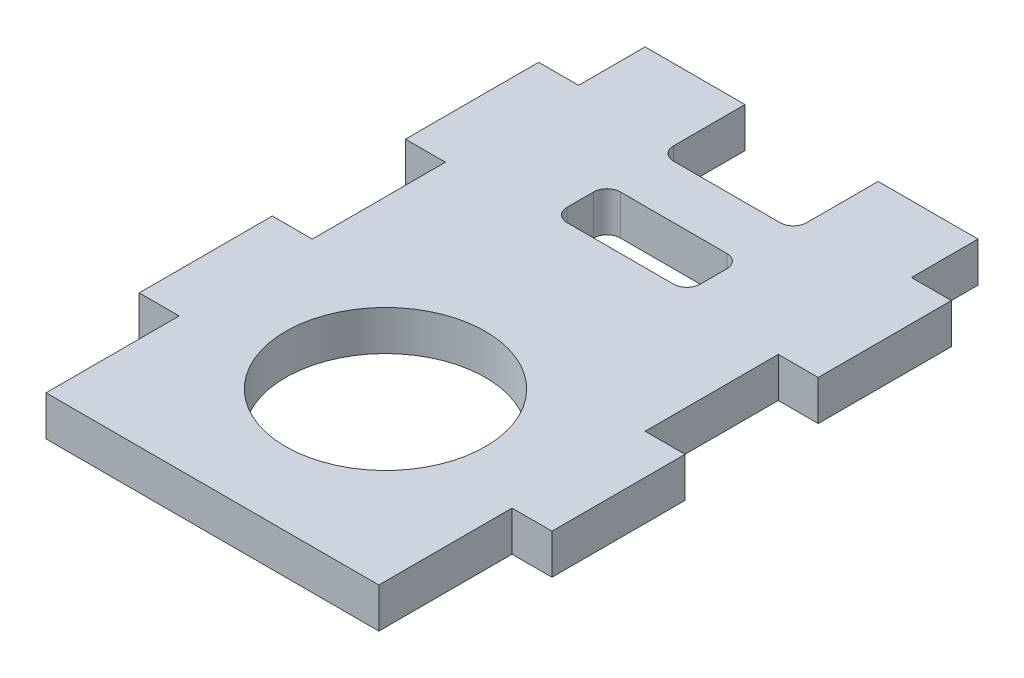
ISO-10303-21;
HEADER;
FILE_DESCRIPTION(('STEP AP214'),'2;1');
FILE_NAME('part.step','',(''),(''),'','','');
FILE_SCHEMA(('AUTOMOTIVE_DESIGN { 1 0 10303 214 1 1 1 1 }'));
ENDSEC;
DATA;
#1=APPLICATION_CONTEXT('core data for automotive mechanical design processes');
#2=APPLICATION_PROTOCOL_DEFINITION('international standard','automotive_design',2000,#1);
#3=PRODUCT_CONTEXT('',#1,'mechanical');
#4=PRODUCT('Part','Part','',(#3));
#5=PRODUCT_RELATED_PRODUCT_CATEGORY('part','',(#4));
#6=PRODUCT_DEFINITION_FORMATION('','',#4);
#7=PRODUCT_DEFINITION_CONTEXT('part definition',#1,'design');
#8=PRODUCT_DEFINITION('design','',#6,#7);
#9=PRODUCT_DEFINITION_SHAPE('','',#8);
#10=(LENGTH_UNIT() NAMED_UNIT(*) SI_UNIT(.MILLI.,.METRE.));
#11=(NAMED_UNIT(*) PLANE_ANGLE_UNIT() SI_UNIT($,.RADIAN.));
#12=(NAMED_UNIT(*) SI_UNIT($,.STERADIAN.) SOLID_ANGLE_UNIT());
#13=UNCERTAINTY_MEASURE_WITH_UNIT(LENGTH_MEASURE(1.E-05),#10,'distance_accuracy_value','');
#14=(GEOMETRIC_REPRESENTATION_CONTEXT(3) GLOBAL_UNCERTAINTY_ASSIGNED_CONTEXT((#13)) GLOBAL_UNIT_ASSIGNED_CONTEXT((#10,
#11,#12)) REPRESENTATION_CONTEXT('',''));
#15=CARTESIAN_POINT('',(0.,0.,0.));
#16=DIRECTION('',(0.,0.,1.));
#17=DIRECTION('',(1.,0.,0.));
#18=AXIS2_PLACEMENT_3D('',#15,#16,#17);
#19=CARTESIAN_POINT('',(-12.5,3.,22.5));
#20=DIRECTION('',(1.,0.,0.));
#21=DIRECTION('',(0.,0.,-1.));
#22=AXIS2_PLACEMENT_3D('',#19,#20,#21);
#23=PLANE('',#22);
#24=DIRECTION('',(0.,0.,1.));
#25=VECTOR('',#24,1.);
#26=CARTESIAN_POINT('',(-12.5,3.,22.5));
#27=LINE('',#26,#25);
#28=CARTESIAN_POINT('',(-12.5,3.,-7.49999999999999));
#29=VERTEX_POINT('',#28);
#30=CARTESIAN_POINT('',(-12.5,3.,2.50000000000002));
#31=VERTEX_POINT('',#30);
#32=EDGE_CURVE('E37',#29,#31,#27,.T.);
#33=ORIENTED_EDGE('',*,*,#32,.F.);
#34=DIRECTION('',(0.,1.,0.));
#35=VECTOR('',#34,1.);
#36=CARTESIAN_POINT('',(-12.5,-10.4403065089106,-7.5));
#37=LINE('',#36,#35);
#38=CARTESIAN_POINT('',(-12.5,0.,-7.5));
#39=VERTEX_POINT('',#38);
#40=EDGE_CURVE('E268',#39,#29,#37,.T.);
#41=ORIENTED_EDGE('',*,*,#40,.F.);
#42=DIRECTION('',(0.,0.,1.));
#43=VECTOR('',#42,1.);
#44=CARTESIAN_POINT('',(-12.5,0.,22.5));
#45=LINE('',#44,#43);
#46=CARTESIAN_POINT('',(-12.5,0.,2.5));
#47=VERTEX_POINT('',#46);
#48=EDGE_CURVE('E266',#39,#47,#45,.T.);
#49=ORIENTED_EDGE('',*,*,#48,.T.);
#50=DIRECTION('',(0.,1.,0.));
#51=VECTOR('',#50,1.);
#52=CARTESIAN_POINT('',(-12.5,-10.4403065089106,2.5));
#53=LINE('',#52,#51);
#54=EDGE_CURVE('E311',#47,#31,#53,.T.);
#55=ORIENTED_EDGE('',*,*,#54,.T.);
#56=EDGE_LOOP('',(#33,#41,#49,#55));
#57=FACE_BOUND('',#56,.T.);
#58=ADVANCED_FACE('F33',(#57),#23,.F.);
#59=DIRECTION('',(0.,1.,0.));
#60=VECTOR('',#59,1.);
#61=CARTESIAN_POINT('',(-12.5,-10.4403065089106,12.5));
#62=LINE('',#61,#60);
#63=CARTESIAN_POINT('',(-12.5,0.,12.5));
#64=VERTEX_POINT('',#63);
#65=CARTESIAN_POINT('',(-12.5,3.,12.5));
#66=VERTEX_POINT('',#65);
#67=EDGE_CURVE('E308',#64,#66,#62,.T.);
#68=ORIENTED_EDGE('',*,*,#67,.F.);
#69=CARTESIAN_POINT('',(-12.5,0.,22.5));
#70=VERTEX_POINT('',#69);
#71=EDGE_CURVE('E324',#64,#70,#45,.T.);
#72=ORIENTED_EDGE('',*,*,#71,.T.);
#73=DIRECTION('',(0.,-1.,0.));
#74=VECTOR('',#73,1.);
#75=CARTESIAN_POINT('',(-12.5,3.,22.5));
#76=LINE('',#75,#74);
#77=CARTESIAN_POINT('',(-12.5,3.,22.5));
#78=VERTEX_POINT('',#77);
#79=EDGE_CURVE('E402',#78,#70,#76,.T.);
#80=ORIENTED_EDGE('',*,*,#79,.F.);
#81=EDGE_CURVE('E374',#66,#78,#27,.T.);
#82=ORIENTED_EDGE('',*,*,#81,.F.);
#83=EDGE_LOOP('',(#68,#72,#80,#82));
#84=FACE_BOUND('',#83,.T.);
#85=ADVANCED_FACE('F409',(#84),#23,.F.);
#86=CARTESIAN_POINT('',(12.5,3.,22.5));
#87=DIRECTION('',(-1.,0.,0.));
#88=DIRECTION('',(0.,0.,1.));
#89=AXIS2_PLACEMENT_3D('',#86,#87,#88);
#90=PLANE('',#89);
#91=DIRECTION('',(0.,0.,-1.));
#92=VECTOR('',#91,1.);
#93=CARTESIAN_POINT('',(12.5,0.,22.5));
#94=LINE('',#93,#92);
#95=CARTESIAN_POINT('',(12.5,0.,22.5));
#96=VERTEX_POINT('',#95);
#97=CARTESIAN_POINT('',(12.5,0.,12.5));
#98=VERTEX_POINT('',#97);
#99=EDGE_CURVE('E362',#96,#98,#94,.T.);
#100=ORIENTED_EDGE('',*,*,#99,.T.);
#101=DIRECTION('',(0.,1.,0.));
#102=VECTOR('',#101,1.);
#103=CARTESIAN_POINT('',(12.5,-10.4403065089106,12.5));
#104=LINE('',#103,#102);
#105=CARTESIAN_POINT('',(12.5,3.,12.5));
#106=VERTEX_POINT('',#105);
#107=EDGE_CURVE('E968',#98,#106,#104,.T.);
#108=ORIENTED_EDGE('',*,*,#107,.T.);
#109=DIRECTION('',(0.,0.,-1.));
#110=VECTOR('',#109,1.);
#111=CARTESIAN_POINT('',(12.5,3.,22.5));
#112=LINE('',#111,#110);
#113=CARTESIAN_POINT('',(12.5,3.,22.5));
#114=VERTEX_POINT('',#113);
#115=EDGE_CURVE('E341',#114,#106,#112,.T.);
#116=ORIENTED_EDGE('',*,*,#115,.F.);
#117=DIRECTION('',(0.,-1.,0.));
#118=VECTOR('',#117,1.);
#119=CARTESIAN_POINT('',(12.5,3.,22.5));
#120=LINE('',#119,#118);
#121=EDGE_CURVE('E368',#114,#96,#120,.T.);
#122=ORIENTED_EDGE('',*,*,#121,.T.);
#123=EDGE_LOOP('',(#100,#108,#116,#122));
#124=FACE_BOUND('',#123,.T.);
#125=ADVANCED_FACE('F421',(#124),#90,.F.);
#126=DIRECTION('',(0.,1.,0.));
#127=VECTOR('',#126,1.);
#128=CARTESIAN_POINT('',(12.5,-10.4403065089106,-17.5));
#129=LINE('',#128,#127);
#130=CARTESIAN_POINT('',(12.5,0.,-17.5));
#131=VERTEX_POINT('',#130);
#132=CARTESIAN_POINT('',(12.5,3.,-17.5));
#133=VERTEX_POINT('',#132);
#134=EDGE_CURVE('E466',#131,#133,#129,.T.);
#135=ORIENTED_EDGE('',*,*,#134,.F.);
#136=CARTESIAN_POINT('',(12.5,0.,-22.5));
#137=VERTEX_POINT('',#136);
#138=EDGE_CURVE('E359',#131,#137,#94,.T.);
#139=ORIENTED_EDGE('',*,*,#138,.T.);
#140=DIRECTION('',(0.,-1.,0.));
#141=VECTOR('',#140,1.);
#142=CARTESIAN_POINT('',(12.5,3.,-22.5));
#143=LINE('',#142,#141);
#144=CARTESIAN_POINT('',(12.5,3.,-22.5));
#145=VERTEX_POINT('',#144);
#146=EDGE_CURVE('E401',#145,#137,#143,.T.);
#147=ORIENTED_EDGE('',*,*,#146,.F.);
#148=EDGE_CURVE('E342',#133,#145,#112,.T.);
#149=ORIENTED_EDGE('',*,*,#148,.F.);
#150=EDGE_LOOP('',(#135,#139,#147,#149));
#151=FACE_BOUND('',#150,.T.);
#152=ADVANCED_FACE('F426',(#151),#90,.F.);
#153=CARTESIAN_POINT('',(-12.5,3.,-22.5));
#154=DIRECTION('',(0.,0.,1.));
#155=DIRECTION('',(1.,0.,0.));
#156=AXIS2_PLACEMENT_3D('',#153,#154,#155);
#157=PLANE('',#156);
#158=DIRECTION('',(-1.,0.,0.));
#159=VECTOR('',#158,1.);
#160=CARTESIAN_POINT('',(-12.5,3.,-22.5));
#161=LINE('',#160,#159);
#162=CARTESIAN_POINT('',(-5.,3.,-22.5));
#163=VERTEX_POINT('',#162);
#164=CARTESIAN_POINT('',(-12.5,3.,-22.5));
#165=VERTEX_POINT('',#164);
#166=EDGE_CURVE('E358',#163,#165,#161,.T.);
#167=ORIENTED_EDGE('',*,*,#166,.F.);
#168=DIRECTION('',(0.,1.,0.));
#169=VECTOR('',#168,1.);
#170=CARTESIAN_POINT('',(-5.,0.,-22.5));
#171=LINE('',#170,#169);
#172=CARTESIAN_POINT('',(-5.,0.,-22.5));
#173=VERTEX_POINT('',#172);
#174=EDGE_CURVE('E515',#173,#163,#171,.T.);
#175=ORIENTED_EDGE('',*,*,#174,.F.);
#176=DIRECTION('',(-1.,0.,0.));
#177=VECTOR('',#176,1.);
#178=CARTESIAN_POINT('',(-12.5,0.,-22.5));
#179=LINE('',#178,#177);
#180=CARTESIAN_POINT('',(-12.5,0.,-22.5));
#181=VERTEX_POINT('',#180);
#182=EDGE_CURVE('E399',#173,#181,#179,.T.);
#183=ORIENTED_EDGE('',*,*,#182,.T.);
#184=DIRECTION('',(0.,-1.,0.));
#185=VECTOR('',#184,1.);
#186=CARTESIAN_POINT('',(-12.5,3.,-22.5));
#187=LINE('',#186,#185);
#188=EDGE_CURVE('E396',#165,#181,#187,.T.);
#189=ORIENTED_EDGE('',*,*,#188,.F.);
#190=EDGE_LOOP('',(#167,#175,#183,#189));
#191=FACE_BOUND('',#190,.T.);
#192=ADVANCED_FACE('F397',(#191),#157,.F.);
#193=CARTESIAN_POINT('',(12.5,3.,2.50000000000001));
#194=VERTEX_POINT('',#193);
#195=CARTESIAN_POINT('',(12.5,3.,-7.49999999999998));
#196=VERTEX_POINT('',#195);
#197=EDGE_CURVE('E338',#194,#196,#112,.T.);
#198=ORIENTED_EDGE('',*,*,#197,.F.);
#199=DIRECTION('',(0.,1.,0.));
#200=VECTOR('',#199,1.);
#201=CARTESIAN_POINT('',(12.5,-10.4403065089106,2.5));
#202=LINE('',#201,#200);
#203=CARTESIAN_POINT('',(12.5,0.,2.5));
#204=VERTEX_POINT('',#203);
#205=EDGE_CURVE('E450',#204,#194,#202,.T.);
#206=ORIENTED_EDGE('',*,*,#205,.F.);
#207=CARTESIAN_POINT('',(12.5,0.,-7.5));
#208=VERTEX_POINT('',#207);
#209=EDGE_CURVE('E343',#204,#208,#94,.T.);
#210=ORIENTED_EDGE('',*,*,#209,.T.);
#211=DIRECTION('',(0.,1.,0.));
#212=VECTOR('',#211,1.);
#213=CARTESIAN_POINT('',(12.5,-10.4403065089106,-7.5));
#214=LINE('',#213,#212);
#215=EDGE_CURVE('E448',#208,#196,#214,.T.);
#216=ORIENTED_EDGE('',*,*,#215,.T.);
#217=EDGE_LOOP('',(#198,#206,#210,#216));
#218=FACE_BOUND('',#217,.T.);
#219=ADVANCED_FACE('F416',(#218),#90,.F.);
#220=CARTESIAN_POINT('',(5.,0.,-22.5));
#221=VERTEX_POINT('',#220);
#222=EDGE_CURVE('E328',#137,#221,#179,.T.);
#223=ORIENTED_EDGE('',*,*,#222,.T.);
#224=DIRECTION('',(0.,1.,0.));
#225=VECTOR('',#224,1.);
#226=CARTESIAN_POINT('',(5.,0.,-22.5));
#227=LINE('',#226,#225);
#228=CARTESIAN_POINT('',(5.,3.,-22.5));
#229=VERTEX_POINT('',#228);
#230=EDGE_CURVE('E509',#221,#229,#227,.T.);
#231=ORIENTED_EDGE('',*,*,#230,.T.);
#232=EDGE_CURVE('E350',#145,#229,#161,.T.);
#233=ORIENTED_EDGE('',*,*,#232,.F.);
#234=ORIENTED_EDGE('',*,*,#146,.T.);
#235=EDGE_LOOP('',(#223,#231,#233,#234));
#236=FACE_BOUND('',#235,.T.);
#237=ADVANCED_FACE('F407',(#236),#157,.F.);
#238=CARTESIAN_POINT('',(-12.5,0.,-17.5));
#239=VERTEX_POINT('',#238);
#240=EDGE_CURVE('E323',#181,#239,#45,.T.);
#241=ORIENTED_EDGE('',*,*,#240,.T.);
#242=DIRECTION('',(0.,1.,0.));
#243=VECTOR('',#242,1.);
#244=CARTESIAN_POINT('',(-12.5,-10.4403065089106,-17.5));
#245=LINE('',#244,#243);
#246=CARTESIAN_POINT('',(-12.5,3.,-17.5));
#247=VERTEX_POINT('',#246);
#248=EDGE_CURVE('E58',#239,#247,#245,.T.);
#249=ORIENTED_EDGE('',*,*,#248,.T.);
#250=EDGE_CURVE('E369',#165,#247,#27,.T.);
#251=ORIENTED_EDGE('',*,*,#250,.F.);
#252=ORIENTED_EDGE('',*,*,#188,.T.);
#253=EDGE_LOOP('',(#241,#249,#251,#252));
#254=FACE_BOUND('',#253,.T.);
#255=ADVANCED_FACE('F404',(#254),#23,.F.);
#256=CARTESIAN_POINT('',(-12.5,3.,22.5));
#257=DIRECTION('',(0.,0.,-1.));
#258=DIRECTION('',(-1.,0.,0.));
#259=AXIS2_PLACEMENT_3D('',#256,#257,#258);
#260=PLANE('',#259);
#261=DIRECTION('',(1.,0.,0.));
#262=VECTOR('',#261,1.);
#263=CARTESIAN_POINT('',(-12.5,0.,22.5));
#264=LINE('',#263,#262);
#265=EDGE_CURVE('E330',#70,#96,#264,.T.);
#266=ORIENTED_EDGE('',*,*,#265,.T.);
#267=ORIENTED_EDGE('',*,*,#121,.F.);
#268=DIRECTION('',(1.,0.,0.));
#269=VECTOR('',#268,1.);
#270=CARTESIAN_POINT('',(-12.5,3.,22.5));
#271=LINE('',#270,#269);
#272=EDGE_CURVE('E365',#78,#114,#271,.T.);
#273=ORIENTED_EDGE('',*,*,#272,.F.);
#274=ORIENTED_EDGE('',*,*,#79,.T.);
#275=EDGE_LOOP('',(#266,#267,#273,#274));
#276=FACE_BOUND('',#275,.T.);
#277=ADVANCED_FACE('F406',(#276),#260,.F.);
#278=CARTESIAN_POINT('',(0.,3.,0.));
#279=DIRECTION('',(0.,-1.,0.));
#280=DIRECTION('',(0.,0.,-1.));
#281=AXIS2_PLACEMENT_3D('',#278,#279,#280);
#282=PLANE('',#281);
#283=DIRECTION('',(1.,0.,0.));
#284=VECTOR('',#283,1.);
#285=CARTESIAN_POINT('',(-5.,3.,-8.135));
#286=LINE('',#285,#284);
#287=CARTESIAN_POINT('',(-4.,3.,-8.135));
#288=VERTEX_POINT('',#287);
#289=CARTESIAN_POINT('',(4.,3.,-8.135));
#290=VERTEX_POINT('',#289);
#291=EDGE_CURVE('E469',#288,#290,#286,.T.);
#292=ORIENTED_EDGE('',*,*,#291,.F.);
#293=CARTESIAN_POINT('',(-4.,3.,-9.135));
#294=DIRECTION('',(0.,-1.,0.));
#295=DIRECTION('',(0.,0.,-1.));
#296=AXIS2_PLACEMENT_3D('',#293,#294,#295);
#297=CIRCLE('',#296,1.);
#298=CARTESIAN_POINT('',(-5.,3.,-9.135));
#299=VERTEX_POINT('',#298);
#300=EDGE_CURVE('E634',#288,#299,#297,.T.);
#301=ORIENTED_EDGE('',*,*,#300,.T.);
#302=DIRECTION('',(0.,0.,1.));
#303=VECTOR('',#302,1.);
#304=CARTESIAN_POINT('',(-5.,3.,-12.135));
#305=LINE('',#304,#303);
#306=CARTESIAN_POINT('',(-5.,3.,-11.135));
#307=VERTEX_POINT('',#306);
#308=EDGE_CURVE('E465',#307,#299,#305,.T.);
#309=ORIENTED_EDGE('',*,*,#308,.F.);
#310=CARTESIAN_POINT('',(-4.,3.,-11.135));
#311=DIRECTION('',(0.,-1.,0.));
#312=DIRECTION('',(0.,0.,-1.));
#313=AXIS2_PLACEMENT_3D('',#310,#311,#312);
#314=CIRCLE('',#313,1.);
#315=CARTESIAN_POINT('',(-4.,3.,-12.135));
#316=VERTEX_POINT('',#315);
#317=EDGE_CURVE('E638',#307,#316,#314,.T.);
#318=ORIENTED_EDGE('',*,*,#317,.T.);
#319=DIRECTION('',(-1.,0.,0.));
#320=VECTOR('',#319,1.);
#321=CARTESIAN_POINT('',(-5.,3.,-12.135));
#322=LINE('',#321,#320);
#323=CARTESIAN_POINT('',(4.,3.,-12.135));
#324=VERTEX_POINT('',#323);
#325=EDGE_CURVE('E485',#324,#316,#322,.T.);
#326=ORIENTED_EDGE('',*,*,#325,.F.);
#327=CARTESIAN_POINT('',(4.,3.,-11.135));
#328=DIRECTION('',(0.,-1.,0.));
#329=DIRECTION('',(0.,0.,-1.));
#330=AXIS2_PLACEMENT_3D('',#327,#328,#329);
#331=CIRCLE('',#330,1.);
#332=CARTESIAN_POINT('',(5.,3.,-11.135));
#333=VERTEX_POINT('',#332);
#334=EDGE_CURVE('E630',#324,#333,#331,.T.);
#335=ORIENTED_EDGE('',*,*,#334,.T.);
#336=DIRECTION('',(0.,0.,-1.));
#337=VECTOR('',#336,1.);
#338=CARTESIAN_POINT('',(5.,3.,-12.135));
#339=LINE('',#338,#337);
#340=CARTESIAN_POINT('',(5.,3.,-9.135));
#341=VERTEX_POINT('',#340);
#342=EDGE_CURVE('E496',#341,#333,#339,.T.);
#343=ORIENTED_EDGE('',*,*,#342,.F.);
#344=CARTESIAN_POINT('',(4.,3.,-9.135));
#345=DIRECTION('',(0.,-1.,0.));
#346=DIRECTION('',(0.,0.,-1.));
#347=AXIS2_PLACEMENT_3D('',#344,#345,#346);
#348=CIRCLE('',#347,1.);
#349=EDGE_CURVE('E626',#341,#290,#348,.T.);
#350=ORIENTED_EDGE('',*,*,#349,.T.);
#351=EDGE_LOOP('',(#292,#301,#309,#318,#326,#335,#343,#350));
#352=FACE_BOUND('',#351,.T.);
#353=CARTESIAN_POINT('',(0.,3.,9.5));
#354=DIRECTION('',(0.,1.,0.));
#355=DIRECTION('',(0.,0.,1.));
#356=AXIS2_PLACEMENT_3D('',#353,#354,#355);
#357=CIRCLE('',#356,7.5);
#358=CARTESIAN_POINT('',(0.,3.,17.));
#359=VERTEX_POINT('',#358);
#360=EDGE_CURVE('E348',#359,#359,#357,.T.);
#361=ORIENTED_EDGE('',*,*,#360,.F.);
#362=EDGE_LOOP('',(#361));
#363=FACE_BOUND('',#362,.T.);
#364=DIRECTION('',(1.,0.,0.));
#365=VECTOR('',#364,1.);
#366=CARTESIAN_POINT('',(-5.,3.,-16.135));
#367=LINE('',#366,#365);
#368=CARTESIAN_POINT('',(-4.,3.,-16.135));
#369=VERTEX_POINT('',#368);
#370=CARTESIAN_POINT('',(4.,3.,-16.135));
#371=VERTEX_POINT('',#370);
#372=EDGE_CURVE('E511',#369,#371,#367,.T.);
#373=ORIENTED_EDGE('',*,*,#372,.F.);
#374=CARTESIAN_POINT('',(-4.,3.,-17.135));
#375=DIRECTION('',(0.,-1.,0.));
#376=DIRECTION('',(0.,0.,-1.));
#377=AXIS2_PLACEMENT_3D('',#374,#375,#376);
#378=CIRCLE('',#377,1.);
#379=CARTESIAN_POINT('',(-5.,3.,-17.135));
#380=VERTEX_POINT('',#379);
#381=EDGE_CURVE('E43',#369,#380,#378,.T.);
#382=ORIENTED_EDGE('',*,*,#381,.T.);
#383=DIRECTION('',(0.,0.,1.));
#384=VECTOR('',#383,1.);
#385=CARTESIAN_POINT('',(-5.,3.,-22.5));
#386=LINE('',#385,#384);
#387=EDGE_CURVE('E392',#163,#380,#386,.T.);
#388=ORIENTED_EDGE('',*,*,#387,.F.);
#389=ORIENTED_EDGE('',*,*,#166,.T.);
#390=ORIENTED_EDGE('',*,*,#250,.T.);
#391=DIRECTION('',(-1.,0.,0.));
#392=VECTOR('',#391,1.);
#393=CARTESIAN_POINT('',(-12.5,3.,-17.5));
#394=LINE('',#393,#392);
#395=CARTESIAN_POINT('',(-15.5,3.,-17.5));
#396=VERTEX_POINT('',#395);
#397=EDGE_CURVE('E287',#247,#396,#394,.T.);
#398=ORIENTED_EDGE('',*,*,#397,.T.);
#399=DIRECTION('',(0.,0.,1.));
#400=VECTOR('',#399,1.);
#401=CARTESIAN_POINT('',(-15.5,3.,-17.5));
#402=LINE('',#401,#400);
#403=CARTESIAN_POINT('',(-15.5,3.,-7.49999999999999));
#404=VERTEX_POINT('',#403);
#405=EDGE_CURVE('E283',#396,#404,#402,.T.);
#406=ORIENTED_EDGE('',*,*,#405,.T.);
#407=DIRECTION('',(1.,0.,0.));
#408=VECTOR('',#407,1.);
#409=CARTESIAN_POINT('',(-12.5,3.,-7.5));
#410=LINE('',#409,#408);
#411=EDGE_CURVE('E274',#404,#29,#410,.T.);
#412=ORIENTED_EDGE('',*,*,#411,.T.);
#413=ORIENTED_EDGE('',*,*,#32,.T.);
#414=DIRECTION('',(-1.,0.,0.));
#415=VECTOR('',#414,1.);
#416=CARTESIAN_POINT('',(-12.5,3.,2.5));
#417=LINE('',#416,#415);
#418=CARTESIAN_POINT('',(-15.5,3.,2.50000000000001));
#419=VERTEX_POINT('',#418);
#420=EDGE_CURVE('E294',#31,#419,#417,.T.);
#421=ORIENTED_EDGE('',*,*,#420,.T.);
#422=DIRECTION('',(0.,0.,1.));
#423=VECTOR('',#422,1.);
#424=CARTESIAN_POINT('',(-15.5,3.,2.50000000000001));
#425=LINE('',#424,#423);
#426=CARTESIAN_POINT('',(-15.5,3.,12.5));
#427=VERTEX_POINT('',#426);
#428=EDGE_CURVE('E295',#419,#427,#425,.T.);
#429=ORIENTED_EDGE('',*,*,#428,.T.);
#430=DIRECTION('',(1.,0.,0.));
#431=VECTOR('',#430,1.);
#432=CARTESIAN_POINT('',(-12.5,3.,12.5));
#433=LINE('',#432,#431);
#434=EDGE_CURVE('E298',#427,#66,#433,.T.);
#435=ORIENTED_EDGE('',*,*,#434,.T.);
#436=ORIENTED_EDGE('',*,*,#81,.T.);
#437=ORIENTED_EDGE('',*,*,#272,.T.);
#438=ORIENTED_EDGE('',*,*,#115,.T.);
#439=DIRECTION('',(1.,0.,0.));
#440=VECTOR('',#439,1.);
#441=CARTESIAN_POINT('',(12.5,3.,12.5));
#442=LINE('',#441,#440);
#443=CARTESIAN_POINT('',(15.5,3.,12.5));
#444=VERTEX_POINT('',#443);
#445=EDGE_CURVE('E970',#106,#444,#442,.T.);
#446=ORIENTED_EDGE('',*,*,#445,.T.);
#447=DIRECTION('',(0.,0.,-1.));
#448=VECTOR('',#447,1.);
#449=CARTESIAN_POINT('',(15.5,3.,2.5));
#450=LINE('',#449,#448);
#451=CARTESIAN_POINT('',(15.5,3.,2.5));
#452=VERTEX_POINT('',#451);
#453=EDGE_CURVE('E1002',#444,#452,#450,.T.);
#454=ORIENTED_EDGE('',*,*,#453,.T.);
#455=DIRECTION('',(-1.,0.,0.));
#456=VECTOR('',#455,1.);
#457=CARTESIAN_POINT('',(12.5,3.,2.5));
#458=LINE('',#457,#456);
#459=EDGE_CURVE('E965',#452,#194,#458,.T.);
#460=ORIENTED_EDGE('',*,*,#459,.T.);
#461=ORIENTED_EDGE('',*,*,#197,.T.);
#462=DIRECTION('',(1.,0.,0.));
#463=VECTOR('',#462,1.);
#464=CARTESIAN_POINT('',(12.5,3.,-7.5));
#465=LINE('',#464,#463);
#466=CARTESIAN_POINT('',(15.5,3.,-7.5));
#467=VERTEX_POINT('',#466);
#468=EDGE_CURVE('E464',#196,#467,#465,.T.);
#469=ORIENTED_EDGE('',*,*,#468,.T.);
#470=DIRECTION('',(0.,0.,-1.));
#471=VECTOR('',#470,1.);
#472=CARTESIAN_POINT('',(15.5,3.,-17.5));
#473=LINE('',#472,#471);
#474=CARTESIAN_POINT('',(15.5,3.,-17.5));
#475=VERTEX_POINT('',#474);
#476=EDGE_CURVE('E972',#467,#475,#473,.T.);
#477=ORIENTED_EDGE('',*,*,#476,.T.);
#478=DIRECTION('',(-1.,0.,0.));
#479=VECTOR('',#478,1.);
#480=CARTESIAN_POINT('',(12.5,3.,-17.5));
#481=LINE('',#480,#479);
#482=EDGE_CURVE('E459',#475,#133,#481,.T.);
#483=ORIENTED_EDGE('',*,*,#482,.T.);
#484=ORIENTED_EDGE('',*,*,#148,.T.);
#485=ORIENTED_EDGE('',*,*,#232,.T.);
#486=DIRECTION('',(0.,0.,-1.));
#487=VECTOR('',#486,1.);
#488=CARTESIAN_POINT('',(5.,3.,-22.5));
#489=LINE('',#488,#487);
#490=CARTESIAN_POINT('',(5.,3.,-17.135));
#491=VERTEX_POINT('',#490);
#492=EDGE_CURVE('E504',#491,#229,#489,.T.);
#493=ORIENTED_EDGE('',*,*,#492,.F.);
#494=CARTESIAN_POINT('',(4.,3.,-17.135));
#495=DIRECTION('',(0.,-1.,0.));
#496=DIRECTION('',(0.,0.,-1.));
#497=AXIS2_PLACEMENT_3D('',#494,#495,#496);
#498=CIRCLE('',#497,1.);
#499=EDGE_CURVE('E642',#491,#371,#498,.T.);
#500=ORIENTED_EDGE('',*,*,#499,.T.);
#501=EDGE_LOOP('',(#373,#382,#388,#389,#390,#398,#406,#412,#413,#421,#429,#435,#436,#437,#438,
#446,#454,#460,#461,#469,#477,#483,#484,#485,#493,#500));
#502=FACE_BOUND('',#501,.T.);
#503=ADVANCED_FACE('F390',(#352,#363,#502),#282,.F.);
#504=CARTESIAN_POINT('',(0.,0.,0.));
#505=DIRECTION('',(0.,-1.,0.));
#506=DIRECTION('',(0.,0.,-1.));
#507=AXIS2_PLACEMENT_3D('',#504,#505,#506);
#508=PLANE('',#507);
#509=DIRECTION('',(-1.,0.,0.));
#510=VECTOR('',#509,1.);
#511=CARTESIAN_POINT('',(-5.,0.,-12.135));
#512=LINE('',#511,#510);
#513=CARTESIAN_POINT('',(4.,0.,-12.135));
#514=VERTEX_POINT('',#513);
#515=CARTESIAN_POINT('',(-4.,0.,-12.135));
#516=VERTEX_POINT('',#515);
#517=EDGE_CURVE('E491',#514,#516,#512,.T.);
#518=ORIENTED_EDGE('',*,*,#517,.T.);
#519=CARTESIAN_POINT('',(-4.,0.,-11.135));
#520=DIRECTION('',(0.,-1.,0.));
#521=DIRECTION('',(0.,0.,-1.));
#522=AXIS2_PLACEMENT_3D('',#519,#520,#521);
#523=CIRCLE('',#522,1.);
#524=CARTESIAN_POINT('',(-5.,0.,-11.135));
#525=VERTEX_POINT('',#524);
#526=EDGE_CURVE('E640',#516,#525,#523,.F.);
#527=ORIENTED_EDGE('',*,*,#526,.T.);
#528=DIRECTION('',(0.,0.,1.));
#529=VECTOR('',#528,1.);
#530=CARTESIAN_POINT('',(-5.,0.,-12.135));
#531=LINE('',#530,#529);
#532=CARTESIAN_POINT('',(-5.,0.,-9.135));
#533=VERTEX_POINT('',#532);
#534=EDGE_CURVE('E481',#525,#533,#531,.T.);
#535=ORIENTED_EDGE('',*,*,#534,.T.);
#536=CARTESIAN_POINT('',(-4.,0.,-9.135));
#537=DIRECTION('',(0.,-1.,0.));
#538=DIRECTION('',(0.,0.,-1.));
#539=AXIS2_PLACEMENT_3D('',#536,#537,#538);
#540=CIRCLE('',#539,1.);
#541=CARTESIAN_POINT('',(-4.,0.,-8.135));
#542=VERTEX_POINT('',#541);
#543=EDGE_CURVE('E636',#533,#542,#540,.F.);
#544=ORIENTED_EDGE('',*,*,#543,.T.);
#545=DIRECTION('',(1.,0.,0.));
#546=VECTOR('',#545,1.);
#547=CARTESIAN_POINT('',(-5.,0.,-8.135));
#548=LINE('',#547,#546);
#549=CARTESIAN_POINT('',(4.,0.,-8.135));
#550=VERTEX_POINT('',#549);
#551=EDGE_CURVE('E484',#542,#550,#548,.T.);
#552=ORIENTED_EDGE('',*,*,#551,.T.);
#553=CARTESIAN_POINT('',(4.,0.,-9.135));
#554=DIRECTION('',(0.,-1.,0.));
#555=DIRECTION('',(0.,0.,-1.));
#556=AXIS2_PLACEMENT_3D('',#553,#554,#555);
#557=CIRCLE('',#556,1.);
#558=CARTESIAN_POINT('',(5.,0.,-9.135));
#559=VERTEX_POINT('',#558);
#560=EDGE_CURVE('E628',#550,#559,#557,.F.);
#561=ORIENTED_EDGE('',*,*,#560,.T.);
#562=DIRECTION('',(0.,0.,-1.));
#563=VECTOR('',#562,1.);
#564=CARTESIAN_POINT('',(5.,0.,-12.135));
#565=LINE('',#564,#563);
#566=CARTESIAN_POINT('',(5.,0.,-11.135));
#567=VERTEX_POINT('',#566);
#568=EDGE_CURVE('E488',#559,#567,#565,.T.);
#569=ORIENTED_EDGE('',*,*,#568,.T.);
#570=CARTESIAN_POINT('',(4.,0.,-11.135));
#571=DIRECTION('',(0.,-1.,0.));
#572=DIRECTION('',(0.,0.,-1.));
#573=AXIS2_PLACEMENT_3D('',#570,#571,#572);
#574=CIRCLE('',#573,1.);
#575=EDGE_CURVE('E632',#567,#514,#574,.F.);
#576=ORIENTED_EDGE('',*,*,#575,.T.);
#577=EDGE_LOOP('',(#518,#527,#535,#544,#552,#561,#569,#576));
#578=FACE_BOUND('',#577,.T.);
#579=DIRECTION('',(0.,0.,1.));
#580=VECTOR('',#579,1.);
#581=CARTESIAN_POINT('',(-5.,0.,-22.5));
#582=LINE('',#581,#580);
#583=CARTESIAN_POINT('',(-5.,0.,-17.135));
#584=VERTEX_POINT('',#583);
#585=EDGE_CURVE('E501',#173,#584,#582,.T.);
#586=ORIENTED_EDGE('',*,*,#585,.T.);
#587=CARTESIAN_POINT('',(-4.,0.,-17.135));
#588=DIRECTION('',(0.,-1.,0.));
#589=DIRECTION('',(0.,0.,-1.));
#590=AXIS2_PLACEMENT_3D('',#587,#588,#589);
#591=CIRCLE('',#590,1.);
#592=CARTESIAN_POINT('',(-4.,0.,-16.135));
#593=VERTEX_POINT('',#592);
#594=EDGE_CURVE('E11',#584,#593,#591,.F.);
#595=ORIENTED_EDGE('',*,*,#594,.T.);
#596=DIRECTION('',(1.,0.,0.));
#597=VECTOR('',#596,1.);
#598=CARTESIAN_POINT('',(-5.,0.,-16.135));
#599=LINE('',#598,#597);
#600=CARTESIAN_POINT('',(4.,0.,-16.135));
#601=VERTEX_POINT('',#600);
#602=EDGE_CURVE('E503',#593,#601,#599,.T.);
#603=ORIENTED_EDGE('',*,*,#602,.T.);
#604=CARTESIAN_POINT('',(4.,0.,-17.135));
#605=DIRECTION('',(0.,-1.,0.));
#606=DIRECTION('',(0.,0.,-1.));
#607=AXIS2_PLACEMENT_3D('',#604,#605,#606);
#608=CIRCLE('',#607,1.);
#609=CARTESIAN_POINT('',(5.,0.,-17.135));
#610=VERTEX_POINT('',#609);
#611=EDGE_CURVE('E644',#601,#610,#608,.F.);
#612=ORIENTED_EDGE('',*,*,#611,.T.);
#613=DIRECTION('',(0.,0.,-1.));
#614=VECTOR('',#613,1.);
#615=CARTESIAN_POINT('',(5.,0.,-22.5));
#616=LINE('',#615,#614);
#617=EDGE_CURVE('E507',#610,#221,#616,.T.);
#618=ORIENTED_EDGE('',*,*,#617,.T.);
#619=ORIENTED_EDGE('',*,*,#222,.F.);
#620=ORIENTED_EDGE('',*,*,#138,.F.);
#621=DIRECTION('',(-1.,0.,0.));
#622=VECTOR('',#621,1.);
#623=CARTESIAN_POINT('',(12.5,0.,-17.5));
#624=LINE('',#623,#622);
#625=CARTESIAN_POINT('',(15.5,0.,-17.5));
#626=VERTEX_POINT('',#625);
#627=EDGE_CURVE('E471',#626,#131,#624,.T.);
#628=ORIENTED_EDGE('',*,*,#627,.F.);
#629=DIRECTION('',(0.,0.,-1.));
#630=VECTOR('',#629,1.);
#631=CARTESIAN_POINT('',(15.5,0.,-17.5));
#632=LINE('',#631,#630);
#633=CARTESIAN_POINT('',(15.5,0.,-7.5));
#634=VERTEX_POINT('',#633);
#635=EDGE_CURVE('E455',#634,#626,#632,.T.);
#636=ORIENTED_EDGE('',*,*,#635,.F.);
#637=DIRECTION('',(1.,0.,0.));
#638=VECTOR('',#637,1.);
#639=CARTESIAN_POINT('',(12.5,0.,-7.5));
#640=LINE('',#639,#638);
#641=EDGE_CURVE('E453',#208,#634,#640,.T.);
#642=ORIENTED_EDGE('',*,*,#641,.F.);
#643=ORIENTED_EDGE('',*,*,#209,.F.);
#644=DIRECTION('',(-1.,0.,0.));
#645=VECTOR('',#644,1.);
#646=CARTESIAN_POINT('',(12.5,0.,2.5));
#647=LINE('',#646,#645);
#648=CARTESIAN_POINT('',(15.5,0.,2.5));
#649=VERTEX_POINT('',#648);
#650=EDGE_CURVE('E973',#649,#204,#647,.T.);
#651=ORIENTED_EDGE('',*,*,#650,.F.);
#652=DIRECTION('',(0.,0.,-1.));
#653=VECTOR('',#652,1.);
#654=CARTESIAN_POINT('',(15.5,0.,2.5));
#655=LINE('',#654,#653);
#656=CARTESIAN_POINT('',(15.5,0.,12.5));
#657=VERTEX_POINT('',#656);
#658=EDGE_CURVE('E962',#657,#649,#655,.T.);
#659=ORIENTED_EDGE('',*,*,#658,.F.);
#660=DIRECTION('',(1.,0.,0.));
#661=VECTOR('',#660,1.);
#662=CARTESIAN_POINT('',(12.5,0.,12.5));
#663=LINE('',#662,#661);
#664=EDGE_CURVE('E959',#98,#657,#663,.T.);
#665=ORIENTED_EDGE('',*,*,#664,.F.);
#666=ORIENTED_EDGE('',*,*,#99,.F.);
#667=ORIENTED_EDGE('',*,*,#265,.F.);
#668=ORIENTED_EDGE('',*,*,#71,.F.);
#669=DIRECTION('',(1.,0.,0.));
#670=VECTOR('',#669,1.);
#671=CARTESIAN_POINT('',(-12.5,0.,12.5));
#672=LINE('',#671,#670);
#673=CARTESIAN_POINT('',(-15.5,0.,12.5));
#674=VERTEX_POINT('',#673);
#675=EDGE_CURVE('E312',#674,#64,#672,.T.);
#676=ORIENTED_EDGE('',*,*,#675,.F.);
#677=DIRECTION('',(0.,0.,1.));
#678=VECTOR('',#677,1.);
#679=CARTESIAN_POINT('',(-15.5,0.,2.50000000000001));
#680=LINE('',#679,#678);
#681=CARTESIAN_POINT('',(-15.5,0.,2.50000000000001));
#682=VERTEX_POINT('',#681);
#683=EDGE_CURVE('E299',#682,#674,#680,.T.);
#684=ORIENTED_EDGE('',*,*,#683,.F.);
#685=DIRECTION('',(-1.,0.,0.));
#686=VECTOR('',#685,1.);
#687=CARTESIAN_POINT('',(-12.5,0.,2.5));
#688=LINE('',#687,#686);
#689=EDGE_CURVE('E320',#47,#682,#688,.T.);
#690=ORIENTED_EDGE('',*,*,#689,.F.);
#691=ORIENTED_EDGE('',*,*,#48,.F.);
#692=DIRECTION('',(1.,0.,0.));
#693=VECTOR('',#692,1.);
#694=CARTESIAN_POINT('',(-12.5,0.,-7.5));
#695=LINE('',#694,#693);
#696=CARTESIAN_POINT('',(-15.5,0.,-7.49999999999999));
#697=VERTEX_POINT('',#696);
#698=EDGE_CURVE('E256',#697,#39,#695,.T.);
#699=ORIENTED_EDGE('',*,*,#698,.F.);
#700=DIRECTION('',(0.,0.,1.));
#701=VECTOR('',#700,1.);
#702=CARTESIAN_POINT('',(-15.5,0.,-17.5));
#703=LINE('',#702,#701);
#704=CARTESIAN_POINT('',(-15.5,0.,-17.5));
#705=VERTEX_POINT('',#704);
#706=EDGE_CURVE('E263',#705,#697,#703,.T.);
#707=ORIENTED_EDGE('',*,*,#706,.F.);
#708=DIRECTION('',(-1.,0.,0.));
#709=VECTOR('',#708,1.);
#710=CARTESIAN_POINT('',(-12.5,0.,-17.5));
#711=LINE('',#710,#709);
#712=EDGE_CURVE('E289',#239,#705,#711,.T.);
#713=ORIENTED_EDGE('',*,*,#712,.F.);
#714=ORIENTED_EDGE('',*,*,#240,.F.);
#715=ORIENTED_EDGE('',*,*,#182,.F.);
#716=EDGE_LOOP('',(#586,#595,#603,#612,#618,#619,#620,#628,#636,#642,#643,#651,#659,#665,#666,
#667,#668,#676,#684,#690,#691,#699,#707,#713,#714,#715));
#717=FACE_BOUND('',#716,.T.);
#718=CARTESIAN_POINT('',(0.,0.,9.5));
#719=DIRECTION('',(0.,1.,0.));
#720=DIRECTION('',(0.,0.,1.));
#721=AXIS2_PLACEMENT_3D('',#718,#719,#720);
#722=CIRCLE('',#721,7.5);
#723=CARTESIAN_POINT('',(0.,0.,17.));
#724=VERTEX_POINT('',#723);
#725=EDGE_CURVE('E361',#724,#724,#722,.T.);
#726=ORIENTED_EDGE('',*,*,#725,.T.);
#727=EDGE_LOOP('',(#726));
#728=FACE_BOUND('',#727,.T.);
#729=ADVANCED_FACE('F259',(#578,#717,#728),#508,.T.);
#730=CARTESIAN_POINT('',(0.,0.,9.5));
#731=DIRECTION('',(0.,1.,0.));
#732=DIRECTION('',(0.,0.,1.));
#733=AXIS2_PLACEMENT_3D('',#730,#731,#732);
#734=CYLINDRICAL_SURFACE('',#733,7.5);
#735=ORIENTED_EDGE('',*,*,#725,.F.);
#736=EDGE_LOOP('',(#735));
#737=FACE_BOUND('',#736,.T.);
#738=ORIENTED_EDGE('',*,*,#360,.T.);
#739=EDGE_LOOP('',(#738));
#740=FACE_BOUND('',#739,.T.);
#741=ADVANCED_FACE('F522',(#737,#740),#734,.F.);
#742=CARTESIAN_POINT('',(-5.,0.,-22.5));
#743=DIRECTION('',(-1.,0.,0.));
#744=DIRECTION('',(0.,0.,1.));
#745=AXIS2_PLACEMENT_3D('',#742,#743,#744);
#746=PLANE('',#745);
#747=ORIENTED_EDGE('',*,*,#387,.T.);
#748=DIRECTION('',(0.,1.,0.));
#749=VECTOR('',#748,1.);
#750=CARTESIAN_POINT('',(-5.,0.,-17.135));
#751=LINE('',#750,#749);
#752=EDGE_CURVE('E613',#380,#584,#751,.F.);
#753=ORIENTED_EDGE('',*,*,#752,.T.);
#754=ORIENTED_EDGE('',*,*,#585,.F.);
#755=ORIENTED_EDGE('',*,*,#174,.T.);
#756=EDGE_LOOP('',(#747,#753,#754,#755));
#757=FACE_BOUND('',#756,.T.);
#758=ADVANCED_FACE('F536',(#757),#746,.F.);
#759=CARTESIAN_POINT('',(5.,0.,-22.5));
#760=DIRECTION('',(1.,0.,0.));
#761=DIRECTION('',(0.,0.,-1.));
#762=AXIS2_PLACEMENT_3D('',#759,#760,#761);
#763=PLANE('',#762);
#764=ORIENTED_EDGE('',*,*,#617,.F.);
#765=DIRECTION('',(0.,1.,0.));
#766=VECTOR('',#765,1.);
#767=CARTESIAN_POINT('',(5.,3.,-17.135));
#768=LINE('',#767,#766);
#769=EDGE_CURVE('E617',#610,#491,#768,.T.);
#770=ORIENTED_EDGE('',*,*,#769,.T.);
#771=ORIENTED_EDGE('',*,*,#492,.T.);
#772=ORIENTED_EDGE('',*,*,#230,.F.);
#773=EDGE_LOOP('',(#764,#770,#771,#772));
#774=FACE_BOUND('',#773,.T.);
#775=ADVANCED_FACE('F540',(#774),#763,.F.);
#776=CARTESIAN_POINT('',(-5.,0.,-16.135));
#777=DIRECTION('',(0.,0.,1.));
#778=DIRECTION('',(1.,0.,0.));
#779=AXIS2_PLACEMENT_3D('',#776,#777,#778);
#780=PLANE('',#779);
#781=ORIENTED_EDGE('',*,*,#372,.T.);
#782=DIRECTION('',(0.,1.,0.));
#783=VECTOR('',#782,1.);
#784=CARTESIAN_POINT('',(4.,0.,-16.135));
#785=LINE('',#784,#783);
#786=EDGE_CURVE('E616',#371,#601,#785,.F.);
#787=ORIENTED_EDGE('',*,*,#786,.T.);
#788=ORIENTED_EDGE('',*,*,#602,.F.);
#789=DIRECTION('',(0.,1.,0.));
#790=VECTOR('',#789,1.);
#791=CARTESIAN_POINT('',(-4.,3.,-16.135));
#792=LINE('',#791,#790);
#793=EDGE_CURVE('E615',#593,#369,#792,.T.);
#794=ORIENTED_EDGE('',*,*,#793,.T.);
#795=EDGE_LOOP('',(#781,#787,#788,#794));
#796=FACE_BOUND('',#795,.T.);
#797=ADVANCED_FACE('F542',(#796),#780,.F.);
#798=CARTESIAN_POINT('',(-5.,0.,-12.135));
#799=DIRECTION('',(-1.,0.,0.));
#800=DIRECTION('',(0.,0.,1.));
#801=AXIS2_PLACEMENT_3D('',#798,#799,#800);
#802=PLANE('',#801);
#803=ORIENTED_EDGE('',*,*,#308,.T.);
#804=DIRECTION('',(0.,1.,0.));
#805=VECTOR('',#804,1.);
#806=CARTESIAN_POINT('',(-5.,0.,-9.135));
#807=LINE('',#806,#805);
#808=EDGE_CURVE('E621',#299,#533,#807,.F.);
#809=ORIENTED_EDGE('',*,*,#808,.T.);
#810=ORIENTED_EDGE('',*,*,#534,.F.);
#811=DIRECTION('',(0.,1.,0.));
#812=VECTOR('',#811,1.);
#813=CARTESIAN_POINT('',(-5.,3.,-11.135));
#814=LINE('',#813,#812);
#815=EDGE_CURVE('E676',#525,#307,#814,.T.);
#816=ORIENTED_EDGE('',*,*,#815,.T.);
#817=EDGE_LOOP('',(#803,#809,#810,#816));
#818=FACE_BOUND('',#817,.T.);
#819=ADVANCED_FACE('F545',(#818),#802,.F.);
#820=CARTESIAN_POINT('',(-5.,0.,-12.135));
#821=DIRECTION('',(0.,0.,-1.));
#822=DIRECTION('',(-1.,0.,0.));
#823=AXIS2_PLACEMENT_3D('',#820,#821,#822);
#824=PLANE('',#823);
#825=ORIENTED_EDGE('',*,*,#517,.F.);
#826=DIRECTION('',(0.,1.,0.));
#827=VECTOR('',#826,1.);
#828=CARTESIAN_POINT('',(4.,3.,-12.135));
#829=LINE('',#828,#827);
#830=EDGE_CURVE('E673',#514,#324,#829,.T.);
#831=ORIENTED_EDGE('',*,*,#830,.T.);
#832=ORIENTED_EDGE('',*,*,#325,.T.);
#833=DIRECTION('',(0.,1.,0.));
#834=VECTOR('',#833,1.);
#835=CARTESIAN_POINT('',(-4.,0.,-12.135));
#836=LINE('',#835,#834);
#837=EDGE_CURVE('E671',#316,#516,#836,.F.);
#838=ORIENTED_EDGE('',*,*,#837,.T.);
#839=EDGE_LOOP('',(#825,#831,#832,#838));
#840=FACE_BOUND('',#839,.T.);
#841=ADVANCED_FACE('F552',(#840),#824,.F.);
#842=CARTESIAN_POINT('',(5.,0.,-12.135));
#843=DIRECTION('',(1.,0.,0.));
#844=DIRECTION('',(0.,0.,-1.));
#845=AXIS2_PLACEMENT_3D('',#842,#843,#844);
#846=PLANE('',#845);
#847=ORIENTED_EDGE('',*,*,#568,.F.);
#848=DIRECTION('',(0.,1.,0.));
#849=VECTOR('',#848,1.);
#850=CARTESIAN_POINT('',(5.,3.,-9.135));
#851=LINE('',#850,#849);
#852=EDGE_CURVE('E660',#559,#341,#851,.T.);
#853=ORIENTED_EDGE('',*,*,#852,.T.);
#854=ORIENTED_EDGE('',*,*,#342,.T.);
#855=DIRECTION('',(0.,1.,0.));
#856=VECTOR('',#855,1.);
#857=CARTESIAN_POINT('',(5.,0.,-11.135));
#858=LINE('',#857,#856);
#859=EDGE_CURVE('E658',#333,#567,#858,.F.);
#860=ORIENTED_EDGE('',*,*,#859,.T.);
#861=EDGE_LOOP('',(#847,#853,#854,#860));
#862=FACE_BOUND('',#861,.T.);
#863=ADVANCED_FACE('F558',(#862),#846,.F.);
#864=CARTESIAN_POINT('',(-5.,0.,-8.135));
#865=DIRECTION('',(0.,0.,1.));
#866=DIRECTION('',(1.,0.,0.));
#867=AXIS2_PLACEMENT_3D('',#864,#865,#866);
#868=PLANE('',#867);
#869=ORIENTED_EDGE('',*,*,#291,.T.);
#870=DIRECTION('',(0.,1.,0.));
#871=VECTOR('',#870,1.);
#872=CARTESIAN_POINT('',(4.,0.,-8.135));
#873=LINE('',#872,#871);
#874=EDGE_CURVE('E669',#290,#550,#873,.F.);
#875=ORIENTED_EDGE('',*,*,#874,.T.);
#876=ORIENTED_EDGE('',*,*,#551,.F.);
#877=DIRECTION('',(0.,1.,0.));
#878=VECTOR('',#877,1.);
#879=CARTESIAN_POINT('',(-4.,3.,-8.135));
#880=LINE('',#879,#878);
#881=EDGE_CURVE('E666',#542,#288,#880,.T.);
#882=ORIENTED_EDGE('',*,*,#881,.T.);
#883=EDGE_LOOP('',(#869,#875,#876,#882));
#884=FACE_BOUND('',#883,.T.);
#885=ADVANCED_FACE('F554',(#884),#868,.F.);
#886=CARTESIAN_POINT('',(4.,0.,-9.135));
#887=DIRECTION('',(0.,-1.,0.));
#888=DIRECTION('',(0.,0.,-1.));
#889=AXIS2_PLACEMENT_3D('',#886,#887,#888);
#890=CYLINDRICAL_SURFACE('',#889,1.);
#891=ORIENTED_EDGE('',*,*,#560,.F.);
#892=ORIENTED_EDGE('',*,*,#874,.F.);
#893=ORIENTED_EDGE('',*,*,#349,.F.);
#894=ORIENTED_EDGE('',*,*,#852,.F.);
#895=EDGE_LOOP('',(#891,#892,#893,#894));
#896=FACE_BOUND('',#895,.T.);
#897=ADVANCED_FACE('F557',(#896),#890,.F.);
#898=CARTESIAN_POINT('',(4.,0.,-11.135));
#899=DIRECTION('',(0.,-1.,0.));
#900=DIRECTION('',(0.,0.,-1.));
#901=AXIS2_PLACEMENT_3D('',#898,#899,#900);
#902=CYLINDRICAL_SURFACE('',#901,1.);
#903=ORIENTED_EDGE('',*,*,#575,.F.);
#904=ORIENTED_EDGE('',*,*,#859,.F.);
#905=ORIENTED_EDGE('',*,*,#334,.F.);
#906=ORIENTED_EDGE('',*,*,#830,.F.);
#907=EDGE_LOOP('',(#903,#904,#905,#906));
#908=FACE_BOUND('',#907,.T.);
#909=ADVANCED_FACE('F699',(#908),#902,.F.);
#910=CARTESIAN_POINT('',(-4.,0.,-9.135));
#911=DIRECTION('',(0.,-1.,0.));
#912=DIRECTION('',(0.,0.,-1.));
#913=AXIS2_PLACEMENT_3D('',#910,#911,#912);
#914=CYLINDRICAL_SURFACE('',#913,1.);
#915=ORIENTED_EDGE('',*,*,#543,.F.);
#916=ORIENTED_EDGE('',*,*,#808,.F.);
#917=ORIENTED_EDGE('',*,*,#300,.F.);
#918=ORIENTED_EDGE('',*,*,#881,.F.);
#919=EDGE_LOOP('',(#915,#916,#917,#918));
#920=FACE_BOUND('',#919,.T.);
#921=ADVANCED_FACE('F687',(#920),#914,.F.);
#922=CARTESIAN_POINT('',(-4.,0.,-11.135));
#923=DIRECTION('',(0.,-1.,0.));
#924=DIRECTION('',(0.,0.,-1.));
#925=AXIS2_PLACEMENT_3D('',#922,#923,#924);
#926=CYLINDRICAL_SURFACE('',#925,1.);
#927=ORIENTED_EDGE('',*,*,#526,.F.);
#928=ORIENTED_EDGE('',*,*,#837,.F.);
#929=ORIENTED_EDGE('',*,*,#317,.F.);
#930=ORIENTED_EDGE('',*,*,#815,.F.);
#931=EDGE_LOOP('',(#927,#928,#929,#930));
#932=FACE_BOUND('',#931,.T.);
#933=ADVANCED_FACE('F703',(#932),#926,.F.);
#934=CARTESIAN_POINT('',(4.,0.,-17.135));
#935=DIRECTION('',(0.,-1.,0.));
#936=DIRECTION('',(0.,0.,-1.));
#937=AXIS2_PLACEMENT_3D('',#934,#935,#936);
#938=CYLINDRICAL_SURFACE('',#937,1.);
#939=ORIENTED_EDGE('',*,*,#611,.F.);
#940=ORIENTED_EDGE('',*,*,#786,.F.);
#941=ORIENTED_EDGE('',*,*,#499,.F.);
#942=ORIENTED_EDGE('',*,*,#769,.F.);
#943=EDGE_LOOP('',(#939,#940,#941,#942));
#944=FACE_BOUND('',#943,.T.);
#945=ADVANCED_FACE('F649',(#944),#938,.F.);
#946=CARTESIAN_POINT('',(-4.,0.,-17.135));
#947=DIRECTION('',(0.,-1.,0.));
#948=DIRECTION('',(0.,0.,-1.));
#949=AXIS2_PLACEMENT_3D('',#946,#947,#948);
#950=CYLINDRICAL_SURFACE('',#949,1.);
#951=ORIENTED_EDGE('',*,*,#594,.F.);
#952=ORIENTED_EDGE('',*,*,#752,.F.);
#953=ORIENTED_EDGE('',*,*,#381,.F.);
#954=ORIENTED_EDGE('',*,*,#793,.F.);
#955=EDGE_LOOP('',(#951,#952,#953,#954));
#956=FACE_BOUND('',#955,.T.);
#957=ADVANCED_FACE('F35',(#956),#950,.F.);
#958=CARTESIAN_POINT('',(12.5,-10.4403065089106,-7.5));
#959=DIRECTION('',(0.,0.,1.));
#960=DIRECTION('',(1.,0.,0.));
#961=AXIS2_PLACEMENT_3D('',#958,#959,#960);
#962=PLANE('',#961);
#963=ORIENTED_EDGE('',*,*,#215,.F.);
#964=ORIENTED_EDGE('',*,*,#641,.T.);
#965=DIRECTION('',(0.,1.,0.));
#966=VECTOR('',#965,1.);
#967=CARTESIAN_POINT('',(15.5,-10.4403065089106,-7.5));
#968=LINE('',#967,#966);
#969=EDGE_CURVE('E458',#634,#467,#968,.T.);
#970=ORIENTED_EDGE('',*,*,#969,.T.);
#971=ORIENTED_EDGE('',*,*,#468,.F.);
#972=EDGE_LOOP('',(#963,#964,#970,#971));
#973=FACE_BOUND('',#972,.T.);
#974=ADVANCED_FACE('F462',(#973),#962,.T.);
#975=CARTESIAN_POINT('',(15.5,-10.4403065089106,-17.5));
#976=DIRECTION('',(1.,0.,0.));
#977=DIRECTION('',(0.,0.,-1.));
#978=AXIS2_PLACEMENT_3D('',#975,#976,#977);
#979=PLANE('',#978);
#980=ORIENTED_EDGE('',*,*,#969,.F.);
#981=ORIENTED_EDGE('',*,*,#635,.T.);
#982=DIRECTION('',(0.,1.,0.));
#983=VECTOR('',#982,1.);
#984=CARTESIAN_POINT('',(15.5,-10.4403065089106,-17.5));
#985=LINE('',#984,#983);
#986=EDGE_CURVE('E981',#626,#475,#985,.T.);
#987=ORIENTED_EDGE('',*,*,#986,.T.);
#988=ORIENTED_EDGE('',*,*,#476,.F.);
#989=EDGE_LOOP('',(#980,#981,#987,#988));
#990=FACE_BOUND('',#989,.T.);
#991=ADVANCED_FACE('F568',(#990),#979,.T.);
#992=CARTESIAN_POINT('',(12.5,-10.4403065089106,-17.5));
#993=DIRECTION('',(0.,0.,-1.));
#994=DIRECTION('',(-1.,0.,0.));
#995=AXIS2_PLACEMENT_3D('',#992,#993,#994);
#996=PLANE('',#995);
#997=ORIENTED_EDGE('',*,*,#986,.F.);
#998=ORIENTED_EDGE('',*,*,#627,.T.);
#999=ORIENTED_EDGE('',*,*,#134,.T.);
#1000=ORIENTED_EDGE('',*,*,#482,.F.);
#1001=EDGE_LOOP('',(#997,#998,#999,#1000));
#1002=FACE_BOUND('',#1001,.T.);
#1003=ADVANCED_FACE('F571',(#1002),#996,.T.);
#1004=CARTESIAN_POINT('',(12.5,-10.4403065089106,12.5));
#1005=DIRECTION('',(0.,0.,1.));
#1006=DIRECTION('',(1.,0.,0.));
#1007=AXIS2_PLACEMENT_3D('',#1004,#1005,#1006);
#1008=PLANE('',#1007);
#1009=ORIENTED_EDGE('',*,*,#107,.F.);
#1010=ORIENTED_EDGE('',*,*,#664,.T.);
#1011=DIRECTION('',(0.,1.,0.));
#1012=VECTOR('',#1011,1.);
#1013=CARTESIAN_POINT('',(15.5,-10.4403065089106,12.5));
#1014=LINE('',#1013,#1012);
#1015=EDGE_CURVE('E964',#657,#444,#1014,.T.);
#1016=ORIENTED_EDGE('',*,*,#1015,.T.);
#1017=ORIENTED_EDGE('',*,*,#445,.F.);
#1018=EDGE_LOOP('',(#1009,#1010,#1016,#1017));
#1019=FACE_BOUND('',#1018,.T.);
#1020=ADVANCED_FACE('F575',(#1019),#1008,.T.);
#1021=CARTESIAN_POINT('',(15.5,-10.4403065089106,2.5));
#1022=DIRECTION('',(1.,0.,0.));
#1023=DIRECTION('',(0.,0.,-1.));
#1024=AXIS2_PLACEMENT_3D('',#1021,#1022,#1023);
#1025=PLANE('',#1024);
#1026=ORIENTED_EDGE('',*,*,#1015,.F.);
#1027=ORIENTED_EDGE('',*,*,#658,.T.);
#1028=DIRECTION('',(0.,1.,0.));
#1029=VECTOR('',#1028,1.);
#1030=CARTESIAN_POINT('',(15.5,-10.4403065089106,2.5));
#1031=LINE('',#1030,#1029);
#1032=EDGE_CURVE('E997',#649,#452,#1031,.T.);
#1033=ORIENTED_EDGE('',*,*,#1032,.T.);
#1034=ORIENTED_EDGE('',*,*,#453,.F.);
#1035=EDGE_LOOP('',(#1026,#1027,#1033,#1034));
#1036=FACE_BOUND('',#1035,.T.);
#1037=ADVANCED_FACE('F579',(#1036),#1025,.T.);
#1038=CARTESIAN_POINT('',(12.5,-10.4403065089106,2.5));
#1039=DIRECTION('',(0.,0.,-1.));
#1040=DIRECTION('',(-1.,0.,0.));
#1041=AXIS2_PLACEMENT_3D('',#1038,#1039,#1040);
#1042=PLANE('',#1041);
#1043=ORIENTED_EDGE('',*,*,#1032,.F.);
#1044=ORIENTED_EDGE('',*,*,#650,.T.);
#1045=ORIENTED_EDGE('',*,*,#205,.T.);
#1046=ORIENTED_EDGE('',*,*,#459,.F.);
#1047=EDGE_LOOP('',(#1043,#1044,#1045,#1046));
#1048=FACE_BOUND('',#1047,.T.);
#1049=ADVANCED_FACE('F583',(#1048),#1042,.T.);
#1050=CARTESIAN_POINT('',(-12.5,-10.4403065089106,2.5));
#1051=DIRECTION('',(0.,0.,-1.));
#1052=DIRECTION('',(-1.,0.,0.));
#1053=AXIS2_PLACEMENT_3D('',#1050,#1051,#1052);
#1054=PLANE('',#1053);
#1055=ORIENTED_EDGE('',*,*,#54,.F.);
#1056=ORIENTED_EDGE('',*,*,#689,.T.);
#1057=DIRECTION('',(0.,1.,0.));
#1058=VECTOR('',#1057,1.);
#1059=CARTESIAN_POINT('',(-15.5,-10.4403065089106,2.50000000000001));
#1060=LINE('',#1059,#1058);
#1061=EDGE_CURVE('E303',#682,#419,#1060,.T.);
#1062=ORIENTED_EDGE('',*,*,#1061,.T.);
#1063=ORIENTED_EDGE('',*,*,#420,.F.);
#1064=EDGE_LOOP('',(#1055,#1056,#1062,#1063));
#1065=FACE_BOUND('',#1064,.T.);
#1066=ADVANCED_FACE('F587',(#1065),#1054,.T.);
#1067=CARTESIAN_POINT('',(-15.5,-10.4403065089106,2.50000000000001));
#1068=DIRECTION('',(-1.,0.,0.));
#1069=DIRECTION('',(0.,0.,1.));
#1070=AXIS2_PLACEMENT_3D('',#1067,#1068,#1069);
#1071=PLANE('',#1070);
#1072=ORIENTED_EDGE('',*,*,#1061,.F.);
#1073=ORIENTED_EDGE('',*,*,#683,.T.);
#1074=DIRECTION('',(0.,1.,0.));
#1075=VECTOR('',#1074,1.);
#1076=CARTESIAN_POINT('',(-15.5,-10.4403065089106,12.5));
#1077=LINE('',#1076,#1075);
#1078=EDGE_CURVE('E302',#674,#427,#1077,.T.);
#1079=ORIENTED_EDGE('',*,*,#1078,.T.);
#1080=ORIENTED_EDGE('',*,*,#428,.F.);
#1081=EDGE_LOOP('',(#1072,#1073,#1079,#1080));
#1082=FACE_BOUND('',#1081,.T.);
#1083=ADVANCED_FACE('F591',(#1082),#1071,.T.);
#1084=CARTESIAN_POINT('',(-12.5,-10.4403065089106,12.5));
#1085=DIRECTION('',(0.,0.,1.));
#1086=DIRECTION('',(1.,0.,0.));
#1087=AXIS2_PLACEMENT_3D('',#1084,#1085,#1086);
#1088=PLANE('',#1087);
#1089=ORIENTED_EDGE('',*,*,#1078,.F.);
#1090=ORIENTED_EDGE('',*,*,#675,.T.);
#1091=ORIENTED_EDGE('',*,*,#67,.T.);
#1092=ORIENTED_EDGE('',*,*,#434,.F.);
#1093=EDGE_LOOP('',(#1089,#1090,#1091,#1092));
#1094=FACE_BOUND('',#1093,.T.);
#1095=ADVANCED_FACE('F595',(#1094),#1088,.T.);
#1096=CARTESIAN_POINT('',(-15.5,-10.4403065089106,-17.5));
#1097=DIRECTION('',(-1.,0.,0.));
#1098=DIRECTION('',(0.,0.,1.));
#1099=AXIS2_PLACEMENT_3D('',#1096,#1097,#1098);
#1100=PLANE('',#1099);
#1101=DIRECTION('',(0.,1.,0.));
#1102=VECTOR('',#1101,1.);
#1103=CARTESIAN_POINT('',(-15.5,-10.4403065089106,-17.5));
#1104=LINE('',#1103,#1102);
#1105=EDGE_CURVE('E281',#705,#396,#1104,.T.);
#1106=ORIENTED_EDGE('',*,*,#1105,.F.);
#1107=ORIENTED_EDGE('',*,*,#706,.T.);
#1108=DIRECTION('',(0.,1.,0.));
#1109=VECTOR('',#1108,1.);
#1110=CARTESIAN_POINT('',(-15.5,-10.4403065089106,-7.49999999999999));
#1111=LINE('',#1110,#1109);
#1112=EDGE_CURVE('E269',#697,#404,#1111,.T.);
#1113=ORIENTED_EDGE('',*,*,#1112,.T.);
#1114=ORIENTED_EDGE('',*,*,#405,.F.);
#1115=EDGE_LOOP('',(#1106,#1107,#1113,#1114));
#1116=FACE_BOUND('',#1115,.T.);
#1117=ADVANCED_FACE('F280',(#1116),#1100,.T.);
#1118=CARTESIAN_POINT('',(-12.5,-10.4403065089106,-7.5));
#1119=DIRECTION('',(0.,0.,1.));
#1120=DIRECTION('',(1.,0.,0.));
#1121=AXIS2_PLACEMENT_3D('',#1118,#1119,#1120);
#1122=PLANE('',#1121);
#1123=ORIENTED_EDGE('',*,*,#1112,.F.);
#1124=ORIENTED_EDGE('',*,*,#698,.T.);
#1125=ORIENTED_EDGE('',*,*,#40,.T.);
#1126=ORIENTED_EDGE('',*,*,#411,.F.);
#1127=EDGE_LOOP('',(#1123,#1124,#1125,#1126));
#1128=FACE_BOUND('',#1127,.T.);
#1129=ADVANCED_FACE('F272',(#1128),#1122,.T.);
#1130=CARTESIAN_POINT('',(-12.5,-10.4403065089106,-17.5));
#1131=DIRECTION('',(0.,0.,-1.));
#1132=DIRECTION('',(-1.,0.,0.));
#1133=AXIS2_PLACEMENT_3D('',#1130,#1131,#1132);
#1134=PLANE('',#1133);
#1135=ORIENTED_EDGE('',*,*,#248,.F.);
#1136=ORIENTED_EDGE('',*,*,#712,.T.);
#1137=ORIENTED_EDGE('',*,*,#1105,.T.);
#1138=ORIENTED_EDGE('',*,*,#397,.F.);
#1139=EDGE_LOOP('',(#1135,#1136,#1137,#1138));
#1140=FACE_BOUND('',#1139,.T.);
#1141=ADVANCED_FACE('F603',(#1140),#1134,.T.);
#1142=CLOSED_SHELL('',(#58,#85,#125,#152,#192,#219,#237,#255,#277,#503,#729,#741,#758,#775,#797,
#819,#841,#863,#885,#897,#909,#921,#933,#945,#957,#974,#991,#1003,#1020,#1037,#1049,#1066,#1083,
#1095,#1117,#1129,#1141));
#1143=MANIFOLD_SOLID_BREP('B2',#1142);
#1144=ADVANCED_BREP_SHAPE_REPRESENTATION('',(#18,#1143),#14);
#1145=SHAPE_DEFINITION_REPRESENTATION(#9,#1144);
ENDSEC;
END-ISO-10303-21;
